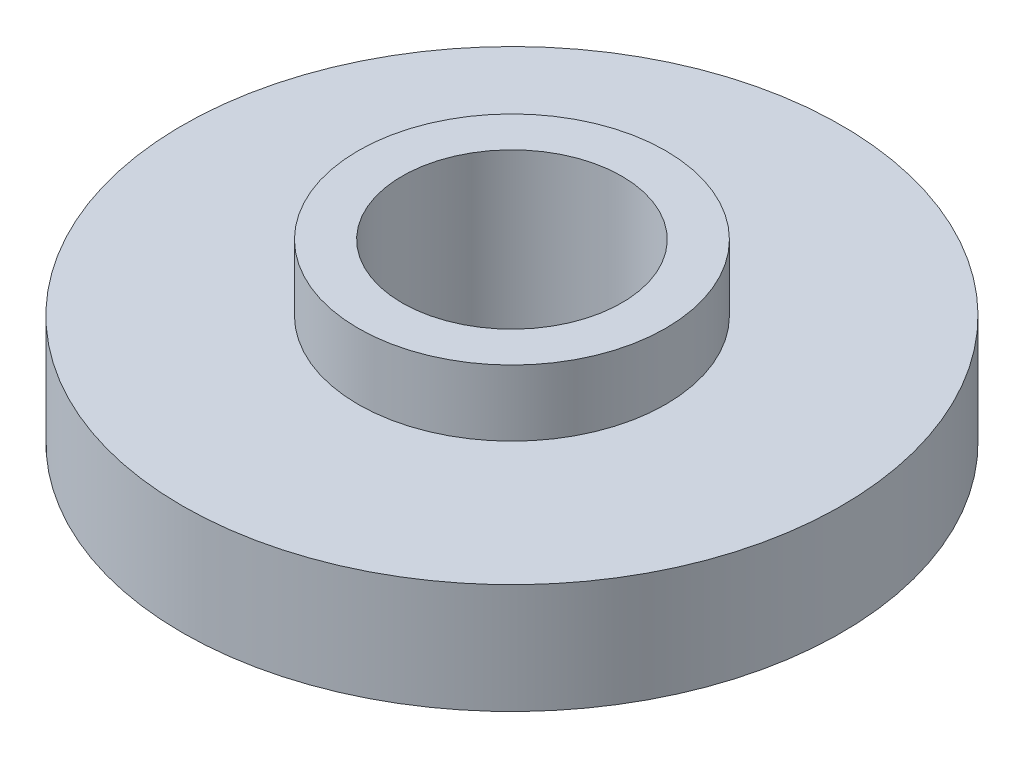
ISO-10303-21;
HEADER;
FILE_DESCRIPTION(('STEP AP214'),'2;1');
FILE_NAME('part.step','',(''),(''),'','','');
FILE_SCHEMA(('AUTOMOTIVE_DESIGN { 1 0 10303 214 1 1 1 1 }'));
ENDSEC;
DATA;
#1=APPLICATION_CONTEXT('core data for automotive mechanical design processes');
#2=APPLICATION_PROTOCOL_DEFINITION('international standard','automotive_design',2000,#1);
#3=PRODUCT_CONTEXT('',#1,'mechanical');
#4=PRODUCT('Part','Part','',(#3));
#5=PRODUCT_RELATED_PRODUCT_CATEGORY('part','',(#4));
#6=PRODUCT_DEFINITION_FORMATION('','',#4);
#7=PRODUCT_DEFINITION_CONTEXT('part definition',#1,'design');
#8=PRODUCT_DEFINITION('design','',#6,#7);
#9=PRODUCT_DEFINITION_SHAPE('','',#8);
#10=(LENGTH_UNIT() NAMED_UNIT(*) SI_UNIT(.MILLI.,.METRE.));
#11=(NAMED_UNIT(*) PLANE_ANGLE_UNIT() SI_UNIT($,.RADIAN.));
#12=(NAMED_UNIT(*) SI_UNIT($,.STERADIAN.) SOLID_ANGLE_UNIT());
#13=UNCERTAINTY_MEASURE_WITH_UNIT(LENGTH_MEASURE(1.E-05),#10,'distance_accuracy_value','');
#14=(GEOMETRIC_REPRESENTATION_CONTEXT(3) GLOBAL_UNCERTAINTY_ASSIGNED_CONTEXT((#13)) GLOBAL_UNIT_ASSIGNED_CONTEXT((#10,
#11,#12)) REPRESENTATION_CONTEXT('',''));
#15=CARTESIAN_POINT('',(0.,0.,0.));
#16=DIRECTION('',(0.,0.,1.));
#17=DIRECTION('',(1.,0.,0.));
#18=AXIS2_PLACEMENT_3D('',#15,#16,#17);
#19=CARTESIAN_POINT('',(0.,2.5,0.));
#20=DIRECTION('',(0.,-1.,0.));
#21=DIRECTION('',(0.,0.,-1.));
#22=AXIS2_PLACEMENT_3D('',#19,#20,#21);
#23=CYLINDRICAL_SURFACE('',#22,7.5);
#24=CARTESIAN_POINT('',(0.,2.5,0.));
#25=DIRECTION('',(0.,1.,0.));
#26=DIRECTION('',(0.,0.,1.));
#27=AXIS2_PLACEMENT_3D('',#24,#25,#26);
#28=CIRCLE('',#27,7.5);
#29=CARTESIAN_POINT('',(0.,2.5,7.5));
#30=VERTEX_POINT('',#29);
#31=EDGE_CURVE('E10',#30,#30,#28,.T.);
#32=ORIENTED_EDGE('',*,*,#31,.F.);
#33=EDGE_LOOP('',(#32));
#34=FACE_BOUND('',#33,.T.);
#35=CARTESIAN_POINT('',(0.,0.,0.));
#36=DIRECTION('',(0.,1.,0.));
#37=DIRECTION('',(0.,0.,1.));
#38=AXIS2_PLACEMENT_3D('',#35,#36,#37);
#39=CIRCLE('',#38,7.5);
#40=CARTESIAN_POINT('',(0.,0.,7.5));
#41=VERTEX_POINT('',#40);
#42=EDGE_CURVE('E40',#41,#41,#39,.T.);
#43=ORIENTED_EDGE('',*,*,#42,.T.);
#44=EDGE_LOOP('',(#43));
#45=FACE_BOUND('',#44,.T.);
#46=ADVANCED_FACE('F37',(#34,#45),#23,.T.);
#47=CARTESIAN_POINT('',(0.,2.5,0.));
#48=DIRECTION('',(0.,1.,0.));
#49=DIRECTION('',(0.,0.,1.));
#50=AXIS2_PLACEMENT_3D('',#47,#48,#49);
#51=PLANE('',#50);
#52=CARTESIAN_POINT('',(0.,2.5,0.));
#53=DIRECTION('',(0.,1.,0.));
#54=DIRECTION('',(0.,0.,1.));
#55=AXIS2_PLACEMENT_3D('',#52,#53,#54);
#56=CIRCLE('',#55,3.5);
#57=CARTESIAN_POINT('',(0.,2.5,3.5));
#58=VERTEX_POINT('',#57);
#59=EDGE_CURVE('E54',#58,#58,#56,.F.);
#60=ORIENTED_EDGE('',*,*,#59,.T.);
#61=EDGE_LOOP('',(#60));
#62=FACE_BOUND('',#61,.T.);
#63=ORIENTED_EDGE('',*,*,#31,.T.);
#64=EDGE_LOOP('',(#63));
#65=FACE_BOUND('',#64,.T.);
#66=ADVANCED_FACE('F87',(#62,#65),#51,.T.);
#67=CARTESIAN_POINT('',(0.,0.,0.));
#68=DIRECTION('',(0.,1.,0.));
#69=DIRECTION('',(0.,0.,1.));
#70=AXIS2_PLACEMENT_3D('',#67,#68,#69);
#71=PLANE('',#70);
#72=ORIENTED_EDGE('',*,*,#42,.F.);
#73=EDGE_LOOP('',(#72));
#74=FACE_BOUND('',#73,.T.);
#75=CARTESIAN_POINT('',(0.,0.,0.));
#76=DIRECTION('',(0.,1.,0.));
#77=DIRECTION('',(0.,0.,1.));
#78=AXIS2_PLACEMENT_3D('',#75,#76,#77);
#79=CIRCLE('',#78,2.5);
#80=CARTESIAN_POINT('',(0.,0.,2.5));
#81=VERTEX_POINT('',#80);
#82=EDGE_CURVE('E49',#81,#81,#79,.T.);
#83=ORIENTED_EDGE('',*,*,#82,.T.);
#84=EDGE_LOOP('',(#83));
#85=FACE_BOUND('',#84,.T.);
#86=ADVANCED_FACE('F82',(#74,#85),#71,.F.);
#87=CARTESIAN_POINT('',(0.,3.5,0.));
#88=DIRECTION('',(0.,-1.,0.));
#89=DIRECTION('',(0.,0.,-1.));
#90=AXIS2_PLACEMENT_3D('',#87,#88,#89);
#91=CYLINDRICAL_SURFACE('',#90,2.5);
#92=ORIENTED_EDGE('',*,*,#82,.F.);
#93=EDGE_LOOP('',(#92));
#94=FACE_BOUND('',#93,.T.);
#95=CARTESIAN_POINT('',(0.,4.,0.));
#96=DIRECTION('',(0.,1.,0.));
#97=DIRECTION('',(0.,0.,1.));
#98=AXIS2_PLACEMENT_3D('',#95,#96,#97);
#99=CIRCLE('',#98,2.5);
#100=CARTESIAN_POINT('',(0.,4.,2.5));
#101=VERTEX_POINT('',#100);
#102=EDGE_CURVE('E62',#101,#101,#99,.T.);
#103=ORIENTED_EDGE('',*,*,#102,.T.);
#104=EDGE_LOOP('',(#103));
#105=FACE_BOUND('',#104,.T.);
#106=ADVANCED_FACE('F67',(#94,#105),#91,.F.);
#107=CARTESIAN_POINT('',(0.,4.,0.));
#108=DIRECTION('',(0.,-1.,0.));
#109=DIRECTION('',(0.,0.,-1.));
#110=AXIS2_PLACEMENT_3D('',#107,#108,#109);
#111=CYLINDRICAL_SURFACE('',#110,3.5);
#112=ORIENTED_EDGE('',*,*,#59,.F.);
#113=EDGE_LOOP('',(#112));
#114=FACE_BOUND('',#113,.T.);
#115=CARTESIAN_POINT('',(0.,4.,0.));
#116=DIRECTION('',(0.,1.,0.));
#117=DIRECTION('',(0.,0.,1.));
#118=AXIS2_PLACEMENT_3D('',#115,#116,#117);
#119=CIRCLE('',#118,3.5);
#120=CARTESIAN_POINT('',(0.,4.,3.5));
#121=VERTEX_POINT('',#120);
#122=EDGE_CURVE('E58',#121,#121,#119,.T.);
#123=ORIENTED_EDGE('',*,*,#122,.F.);
#124=EDGE_LOOP('',(#123));
#125=FACE_BOUND('',#124,.T.);
#126=ADVANCED_FACE('F72',(#114,#125),#111,.T.);
#127=CARTESIAN_POINT('',(0.,4.,0.));
#128=DIRECTION('',(0.,1.,0.));
#129=DIRECTION('',(0.,0.,1.));
#130=AXIS2_PLACEMENT_3D('',#127,#128,#129);
#131=PLANE('',#130);
#132=ORIENTED_EDGE('',*,*,#102,.F.);
#133=EDGE_LOOP('',(#132));
#134=FACE_BOUND('',#133,.T.);
#135=ORIENTED_EDGE('',*,*,#122,.T.);
#136=EDGE_LOOP('',(#135));
#137=FACE_BOUND('',#136,.T.);
#138=ADVANCED_FACE('F69',(#134,#137),#131,.T.);
#139=CLOSED_SHELL('',(#46,#66,#86,#106,#126,#138));
#140=MANIFOLD_SOLID_BREP('B2',#139);
#141=ADVANCED_BREP_SHAPE_REPRESENTATION('',(#18,#140),#14);
#142=SHAPE_DEFINITION_REPRESENTATION(#9,#141);
ENDSEC;
END-ISO-10303-21;
